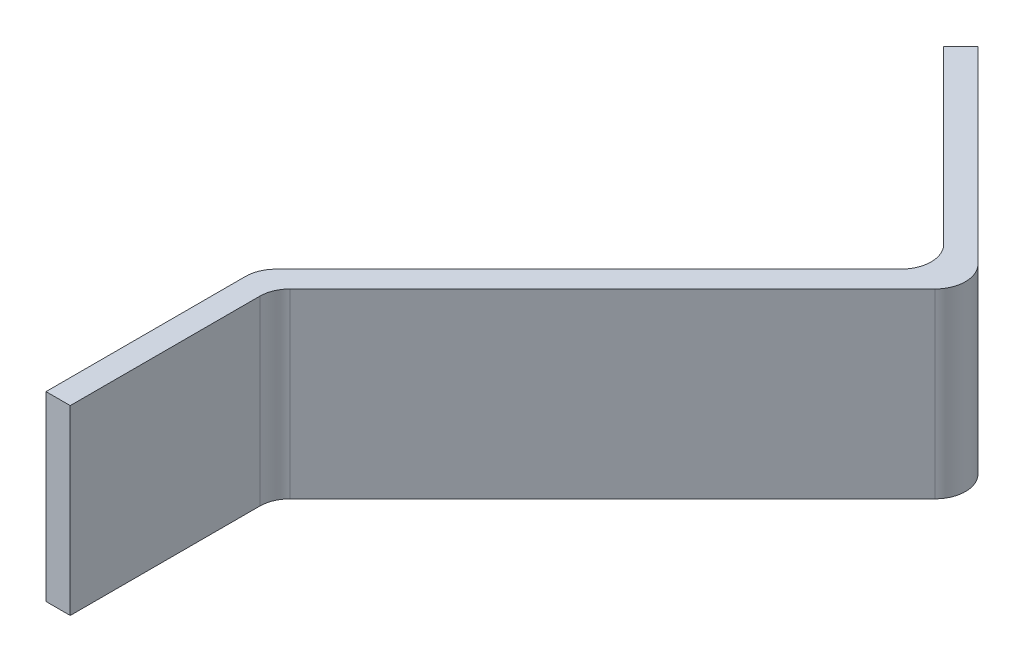
ISO-10303-21;
HEADER;
FILE_DESCRIPTION(('STEP AP214'),'2;1');
FILE_NAME('part.step','',(''),(''),'','','');
FILE_SCHEMA(('AUTOMOTIVE_DESIGN { 1 0 10303 214 1 1 1 1 }'));
ENDSEC;
DATA;
#1=APPLICATION_CONTEXT('core data for automotive mechanical design processes');
#2=APPLICATION_PROTOCOL_DEFINITION('international standard','automotive_design',2000,#1);
#3=PRODUCT_CONTEXT('',#1,'mechanical');
#4=PRODUCT('Part','Part','',(#3));
#5=PRODUCT_RELATED_PRODUCT_CATEGORY('part','',(#4));
#6=PRODUCT_DEFINITION_FORMATION('','',#4);
#7=PRODUCT_DEFINITION_CONTEXT('part definition',#1,'design');
#8=PRODUCT_DEFINITION('design','',#6,#7);
#9=PRODUCT_DEFINITION_SHAPE('','',#8);
#10=(LENGTH_UNIT() NAMED_UNIT(*) SI_UNIT(.MILLI.,.METRE.));
#11=(NAMED_UNIT(*) PLANE_ANGLE_UNIT() SI_UNIT($,.RADIAN.));
#12=(NAMED_UNIT(*) SI_UNIT($,.STERADIAN.) SOLID_ANGLE_UNIT());
#13=UNCERTAINTY_MEASURE_WITH_UNIT(LENGTH_MEASURE(1.E-05),#10,'distance_accuracy_value','');
#14=(GEOMETRIC_REPRESENTATION_CONTEXT(3) GLOBAL_UNCERTAINTY_ASSIGNED_CONTEXT((#13)) GLOBAL_UNIT_ASSIGNED_CONTEXT((#10,
#11,#12)) REPRESENTATION_CONTEXT('',''));
#15=CARTESIAN_POINT('',(0.,0.,0.));
#16=DIRECTION('',(0.,0.,1.));
#17=DIRECTION('',(1.,0.,0.));
#18=AXIS2_PLACEMENT_3D('',#15,#16,#17);
#19=CARTESIAN_POINT('',(245.256587827418,-22.5,-468.225396744416));
#20=DIRECTION('',(0.,1.,0.));
#21=DIRECTION('',(0.,0.,1.));
#22=AXIS2_PLACEMENT_3D('',#19,#20,#21);
#23=CYLINDRICAL_SURFACE('',#22,4.99999999999998);
#24=CARTESIAN_POINT('',(245.256587827418,7.5,-468.225396744416));
#25=DIRECTION('',(0.,1.,0.));
#26=DIRECTION('',(0.,0.,1.));
#27=AXIS2_PLACEMENT_3D('',#24,#25,#26);
#28=CIRCLE('',#27,4.99999999999998);
#29=CARTESIAN_POINT('',(248.79212173335,7.5,-464.689862838483));
#30=VERTEX_POINT('',#29);
#31=CARTESIAN_POINT('',(248.79212173335,7.5,-471.760930650349));
#32=VERTEX_POINT('',#31);
#33=EDGE_CURVE('E154',#30,#32,#28,.T.);
#34=ORIENTED_EDGE('',*,*,#33,.F.);
#35=DIRECTION('',(0.,1.,0.));
#36=VECTOR('',#35,1.);
#37=CARTESIAN_POINT('',(248.79212173335,-22.5,-464.689862838483));
#38=LINE('',#37,#36);
#39=CARTESIAN_POINT('',(248.79212173335,-22.5,-464.689862838483));
#40=VERTEX_POINT('',#39);
#41=EDGE_CURVE('E11',#40,#30,#38,.T.);
#42=ORIENTED_EDGE('',*,*,#41,.F.);
#43=CARTESIAN_POINT('',(245.256587827418,-22.5,-468.225396744416));
#44=DIRECTION('',(0.,1.,0.));
#45=DIRECTION('',(0.,0.,1.));
#46=AXIS2_PLACEMENT_3D('',#43,#44,#45);
#47=CIRCLE('',#46,4.99999999999998);
#48=CARTESIAN_POINT('',(248.79212173335,-22.5,-471.760930650349));
#49=VERTEX_POINT('',#48);
#50=EDGE_CURVE('E186',#40,#49,#47,.T.);
#51=ORIENTED_EDGE('',*,*,#50,.T.);
#52=DIRECTION('',(0.,1.,0.));
#53=VECTOR('',#52,1.);
#54=CARTESIAN_POINT('',(248.79212173335,-22.5,-471.760930650349));
#55=LINE('',#54,#53);
#56=EDGE_CURVE('E36',#49,#32,#55,.T.);
#57=ORIENTED_EDGE('',*,*,#56,.T.);
#58=EDGE_LOOP('',(#34,#42,#51,#57));
#59=FACE_BOUND('',#58,.T.);
#60=ADVANCED_FACE('F33',(#59),#23,.T.);
#61=CARTESIAN_POINT('',(195.566724988934,-22.5,-411.464466094067));
#62=DIRECTION('',(0.707106781186549,0.,0.707106781186546));
#63=DIRECTION('',(0.707106781186546,0.,-0.707106781186549));
#64=AXIS2_PLACEMENT_3D('',#61,#62,#63);
#65=PLANE('',#64);
#66=DIRECTION('',(0.707106781186546,0.,-0.707106781186549));
#67=VECTOR('',#66,1.);
#68=CARTESIAN_POINT('',(195.566724988934,7.5,-411.464466094067));
#69=LINE('',#68,#67);
#70=CARTESIAN_POINT('',(195.566724988934,7.5,-411.464466094067));
#71=VERTEX_POINT('',#70);
#72=EDGE_CURVE('E184',#71,#30,#69,.T.);
#73=ORIENTED_EDGE('',*,*,#72,.F.);
#74=DIRECTION('',(0.,1.,0.));
#75=VECTOR('',#74,1.);
#76=CARTESIAN_POINT('',(195.566724988934,-22.5,-411.464466094067));
#77=LINE('',#76,#75);
#78=CARTESIAN_POINT('',(195.566724988934,-22.5,-411.464466094067));
#79=VERTEX_POINT('',#78);
#80=EDGE_CURVE('E42',#79,#71,#77,.T.);
#81=ORIENTED_EDGE('',*,*,#80,.F.);
#82=DIRECTION('',(0.707106781186546,0.,-0.707106781186549));
#83=VECTOR('',#82,1.);
#84=CARTESIAN_POINT('',(195.566724988934,-22.5,-411.464466094067));
#85=LINE('',#84,#83);
#86=EDGE_CURVE('E144',#79,#40,#85,.T.);
#87=ORIENTED_EDGE('',*,*,#86,.T.);
#88=ORIENTED_EDGE('',*,*,#41,.T.);
#89=EDGE_LOOP('',(#73,#81,#87,#88));
#90=FACE_BOUND('',#89,.T.);
#91=ADVANCED_FACE('F206',(#90),#65,.T.);
#92=CARTESIAN_POINT('',(199.102258894867,-22.5,-407.928932188134));
#93=DIRECTION('',(0.,1.,0.));
#94=DIRECTION('',(0.,0.,1.));
#95=AXIS2_PLACEMENT_3D('',#92,#93,#94);
#96=CYLINDRICAL_SURFACE('',#95,5.00000000000001);
#97=CARTESIAN_POINT('',(199.102258894867,7.5,-407.928932188134));
#98=DIRECTION('',(0.,-1.,0.));
#99=DIRECTION('',(0.,0.,1.));
#100=AXIS2_PLACEMENT_3D('',#97,#98,#99);
#101=CIRCLE('',#100,5.00000000000001);
#102=CARTESIAN_POINT('',(194.102258894867,7.5,-407.928932188134));
#103=VERTEX_POINT('',#102);
#104=EDGE_CURVE('E131',#103,#71,#101,.T.);
#105=ORIENTED_EDGE('',*,*,#104,.F.);
#106=DIRECTION('',(0.,1.,0.));
#107=VECTOR('',#106,1.);
#108=CARTESIAN_POINT('',(194.102258894867,-22.5,-407.928932188134));
#109=LINE('',#108,#107);
#110=CARTESIAN_POINT('',(194.102258894867,-22.5,-407.928932188134));
#111=VERTEX_POINT('',#110);
#112=EDGE_CURVE('E126',#111,#103,#109,.T.);
#113=ORIENTED_EDGE('',*,*,#112,.F.);
#114=CARTESIAN_POINT('',(199.102258894867,-22.5,-407.928932188134));
#115=DIRECTION('',(0.,-1.,0.));
#116=DIRECTION('',(0.,0.,1.));
#117=AXIS2_PLACEMENT_3D('',#114,#115,#116);
#118=CIRCLE('',#117,5.00000000000001);
#119=EDGE_CURVE('E129',#111,#79,#118,.T.);
#120=ORIENTED_EDGE('',*,*,#119,.T.);
#121=ORIENTED_EDGE('',*,*,#80,.T.);
#122=EDGE_LOOP('',(#105,#113,#120,#121));
#123=FACE_BOUND('',#122,.T.);
#124=ADVANCED_FACE('F128',(#123),#96,.F.);
#125=CARTESIAN_POINT('',(194.102258894867,-22.5,-376.656854249492));
#126=DIRECTION('',(1.,0.,0.));
#127=DIRECTION('',(0.,0.,-1.));
#128=AXIS2_PLACEMENT_3D('',#125,#126,#127);
#129=PLANE('',#128);
#130=DIRECTION('',(0.,0.,-1.));
#131=VECTOR('',#130,1.);
#132=CARTESIAN_POINT('',(194.102258894867,7.5,-376.656854249492));
#133=LINE('',#132,#131);
#134=CARTESIAN_POINT('',(194.102258894867,7.5,-376.656854249492));
#135=VERTEX_POINT('',#134);
#136=EDGE_CURVE('E181',#135,#103,#133,.T.);
#137=ORIENTED_EDGE('',*,*,#136,.F.);
#138=DIRECTION('',(0.,1.,0.));
#139=VECTOR('',#138,1.);
#140=CARTESIAN_POINT('',(194.102258894867,-22.5,-376.656854249492));
#141=LINE('',#140,#139);
#142=CARTESIAN_POINT('',(194.102258894867,-22.5,-376.656854249492));
#143=VERTEX_POINT('',#142);
#144=EDGE_CURVE('E136',#143,#135,#141,.T.);
#145=ORIENTED_EDGE('',*,*,#144,.F.);
#146=DIRECTION('',(0.,0.,-1.));
#147=VECTOR('',#146,1.);
#148=CARTESIAN_POINT('',(194.102258894867,-22.5,-376.656854249492));
#149=LINE('',#148,#147);
#150=EDGE_CURVE('E142',#143,#111,#149,.T.);
#151=ORIENTED_EDGE('',*,*,#150,.T.);
#152=ORIENTED_EDGE('',*,*,#112,.T.);
#153=EDGE_LOOP('',(#137,#145,#151,#152));
#154=FACE_BOUND('',#153,.T.);
#155=ADVANCED_FACE('F146',(#154),#129,.T.);
#156=CARTESIAN_POINT('',(190.102258894867,-22.5,-376.656854249492));
#157=DIRECTION('',(0.,0.,1.));
#158=DIRECTION('',(1.,0.,0.));
#159=AXIS2_PLACEMENT_3D('',#156,#157,#158);
#160=PLANE('',#159);
#161=DIRECTION('',(1.,0.,0.));
#162=VECTOR('',#161,1.);
#163=CARTESIAN_POINT('',(190.102258894867,7.5,-376.656854249492));
#164=LINE('',#163,#162);
#165=CARTESIAN_POINT('',(190.102258894867,7.5,-376.656854249492));
#166=VERTEX_POINT('',#165);
#167=EDGE_CURVE('E178',#166,#135,#164,.T.);
#168=ORIENTED_EDGE('',*,*,#167,.F.);
#169=DIRECTION('',(0.,1.,0.));
#170=VECTOR('',#169,1.);
#171=CARTESIAN_POINT('',(190.102258894867,-22.5,-376.656854249492));
#172=LINE('',#171,#170);
#173=CARTESIAN_POINT('',(190.102258894867,-22.5,-376.656854249492));
#174=VERTEX_POINT('',#173);
#175=EDGE_CURVE('E190',#174,#166,#172,.T.);
#176=ORIENTED_EDGE('',*,*,#175,.F.);
#177=DIRECTION('',(1.,0.,0.));
#178=VECTOR('',#177,1.);
#179=CARTESIAN_POINT('',(190.102258894867,-22.5,-376.656854249492));
#180=LINE('',#179,#178);
#181=EDGE_CURVE('E147',#174,#143,#180,.T.);
#182=ORIENTED_EDGE('',*,*,#181,.T.);
#183=ORIENTED_EDGE('',*,*,#144,.T.);
#184=EDGE_LOOP('',(#168,#176,#182,#183));
#185=FACE_BOUND('',#184,.T.);
#186=ADVANCED_FACE('F219',(#185),#160,.T.);
#187=CARTESIAN_POINT('',(190.102258894867,-22.5,-409.585786437627));
#188=DIRECTION('',(-1.,0.,0.));
#189=DIRECTION('',(0.,0.,1.));
#190=AXIS2_PLACEMENT_3D('',#187,#188,#189);
#191=PLANE('',#190);
#192=DIRECTION('',(0.,0.,1.));
#193=VECTOR('',#192,1.);
#194=CARTESIAN_POINT('',(190.102258894867,7.5,-409.585786437627));
#195=LINE('',#194,#193);
#196=CARTESIAN_POINT('',(190.102258894867,7.5,-409.585786437627));
#197=VERTEX_POINT('',#196);
#198=EDGE_CURVE('E175',#197,#166,#195,.T.);
#199=ORIENTED_EDGE('',*,*,#198,.F.);
#200=DIRECTION('',(0.,1.,0.));
#201=VECTOR('',#200,1.);
#202=CARTESIAN_POINT('',(190.102258894867,-22.5,-409.585786437627));
#203=LINE('',#202,#201);
#204=CARTESIAN_POINT('',(190.102258894867,-22.5,-409.585786437627));
#205=VERTEX_POINT('',#204);
#206=EDGE_CURVE('E192',#205,#197,#203,.T.);
#207=ORIENTED_EDGE('',*,*,#206,.F.);
#208=DIRECTION('',(0.,0.,1.));
#209=VECTOR('',#208,1.);
#210=CARTESIAN_POINT('',(190.102258894867,-22.5,-409.585786437627));
#211=LINE('',#210,#209);
#212=EDGE_CURVE('E149',#205,#174,#211,.T.);
#213=ORIENTED_EDGE('',*,*,#212,.T.);
#214=ORIENTED_EDGE('',*,*,#175,.T.);
#215=EDGE_LOOP('',(#199,#207,#213,#214));
#216=FACE_BOUND('',#215,.T.);
#217=ADVANCED_FACE('F222',(#216),#191,.T.);
#218=CARTESIAN_POINT('',(195.102258894867,-22.5,-409.585786437627));
#219=DIRECTION('',(0.,1.,0.));
#220=DIRECTION('',(0.,0.,1.));
#221=AXIS2_PLACEMENT_3D('',#218,#219,#220);
#222=CYLINDRICAL_SURFACE('',#221,5.00000000000001);
#223=CARTESIAN_POINT('',(195.102258894867,7.5,-409.585786437627));
#224=DIRECTION('',(0.,1.,0.));
#225=DIRECTION('',(0.,0.,1.));
#226=AXIS2_PLACEMENT_3D('',#223,#224,#225);
#227=CIRCLE('',#226,5.00000000000001);
#228=CARTESIAN_POINT('',(191.566724988934,7.5,-413.121320343559));
#229=VERTEX_POINT('',#228);
#230=EDGE_CURVE('E172',#229,#197,#227,.T.);
#231=ORIENTED_EDGE('',*,*,#230,.F.);
#232=DIRECTION('',(0.,1.,0.));
#233=VECTOR('',#232,1.);
#234=CARTESIAN_POINT('',(191.566724988934,-22.5,-413.121320343559));
#235=LINE('',#234,#233);
#236=CARTESIAN_POINT('',(191.566724988934,-22.5,-413.121320343559));
#237=VERTEX_POINT('',#236);
#238=EDGE_CURVE('E194',#237,#229,#235,.T.);
#239=ORIENTED_EDGE('',*,*,#238,.F.);
#240=CARTESIAN_POINT('',(195.102258894867,-22.5,-409.585786437627));
#241=DIRECTION('',(0.,1.,0.));
#242=DIRECTION('',(0.,0.,1.));
#243=AXIS2_PLACEMENT_3D('',#240,#241,#242);
#244=CIRCLE('',#243,5.00000000000001);
#245=EDGE_CURVE('E348',#237,#205,#244,.T.);
#246=ORIENTED_EDGE('',*,*,#245,.T.);
#247=ORIENTED_EDGE('',*,*,#206,.T.);
#248=EDGE_LOOP('',(#231,#239,#246,#247));
#249=FACE_BOUND('',#248,.T.);
#250=ADVANCED_FACE('F226',(#249),#222,.T.);
#251=CARTESIAN_POINT('',(243.135267483858,-22.5,-464.689862838483));
#252=DIRECTION('',(-0.707106781186549,0.,-0.707106781186546));
#253=DIRECTION('',(-0.707106781186546,0.,0.707106781186549));
#254=AXIS2_PLACEMENT_3D('',#251,#252,#253);
#255=PLANE('',#254);
#256=DIRECTION('',(-0.707106781186546,0.,0.707106781186549));
#257=VECTOR('',#256,1.);
#258=CARTESIAN_POINT('',(243.135267483858,7.5,-464.689862838483));
#259=LINE('',#258,#257);
#260=CARTESIAN_POINT('',(243.135267483858,7.5,-464.689862838483));
#261=VERTEX_POINT('',#260);
#262=EDGE_CURVE('E169',#261,#229,#259,.T.);
#263=ORIENTED_EDGE('',*,*,#262,.F.);
#264=DIRECTION('',(0.,1.,0.));
#265=VECTOR('',#264,1.);
#266=CARTESIAN_POINT('',(243.135267483858,-22.5,-464.689862838483));
#267=LINE('',#266,#265);
#268=CARTESIAN_POINT('',(243.135267483858,-22.5,-464.689862838483));
#269=VERTEX_POINT('',#268);
#270=EDGE_CURVE('E196',#269,#261,#267,.T.);
#271=ORIENTED_EDGE('',*,*,#270,.F.);
#272=DIRECTION('',(-0.707106781186546,0.,0.707106781186549));
#273=VECTOR('',#272,1.);
#274=CARTESIAN_POINT('',(243.135267483858,-22.5,-464.689862838483));
#275=LINE('',#274,#273);
#276=EDGE_CURVE('E352',#269,#237,#275,.T.);
#277=ORIENTED_EDGE('',*,*,#276,.T.);
#278=ORIENTED_EDGE('',*,*,#238,.T.);
#279=EDGE_LOOP('',(#263,#271,#277,#278));
#280=FACE_BOUND('',#279,.T.);
#281=ADVANCED_FACE('F230',(#280),#255,.T.);
#282=CARTESIAN_POINT('',(239.599733577925,-22.5,-468.225396744416));
#283=DIRECTION('',(0.,1.,0.));
#284=DIRECTION('',(0.,0.,1.));
#285=AXIS2_PLACEMENT_3D('',#282,#283,#284);
#286=CYLINDRICAL_SURFACE('',#285,4.99999999999997);
#287=CARTESIAN_POINT('',(239.599733577925,7.5,-468.225396744416));
#288=DIRECTION('',(0.,-1.,0.));
#289=DIRECTION('',(0.,0.,1.));
#290=AXIS2_PLACEMENT_3D('',#287,#288,#289);
#291=CIRCLE('',#290,4.99999999999997);
#292=CARTESIAN_POINT('',(243.135267483858,7.5,-471.760930650349));
#293=VERTEX_POINT('',#292);
#294=EDGE_CURVE('E166',#293,#261,#291,.T.);
#295=ORIENTED_EDGE('',*,*,#294,.F.);
#296=DIRECTION('',(0.,1.,0.));
#297=VECTOR('',#296,1.);
#298=CARTESIAN_POINT('',(243.135267483858,-22.5,-471.760930650349));
#299=LINE('',#298,#297);
#300=CARTESIAN_POINT('',(243.135267483858,-22.5,-471.760930650349));
#301=VERTEX_POINT('',#300);
#302=EDGE_CURVE('E198',#301,#293,#299,.T.);
#303=ORIENTED_EDGE('',*,*,#302,.F.);
#304=CARTESIAN_POINT('',(239.599733577925,-22.5,-468.225396744416));
#305=DIRECTION('',(0.,-1.,0.));
#306=DIRECTION('',(0.,0.,1.));
#307=AXIS2_PLACEMENT_3D('',#304,#305,#306);
#308=CIRCLE('',#307,4.99999999999997);
#309=EDGE_CURVE('E341',#301,#269,#308,.T.);
#310=ORIENTED_EDGE('',*,*,#309,.T.);
#311=ORIENTED_EDGE('',*,*,#270,.T.);
#312=EDGE_LOOP('',(#295,#303,#310,#311));
#313=FACE_BOUND('',#312,.T.);
#314=ADVANCED_FACE('F234',(#313),#286,.F.);
#315=CARTESIAN_POINT('',(214.850996236396,-22.5,-500.04520189781));
#316=DIRECTION('',(-0.707106781186541,0.,0.707106781186554));
#317=DIRECTION('',(0.707106781186554,0.,0.707106781186541));
#318=AXIS2_PLACEMENT_3D('',#315,#316,#317);
#319=PLANE('',#318);
#320=DIRECTION('',(0.707106781186554,0.,0.707106781186541));
#321=VECTOR('',#320,1.);
#322=CARTESIAN_POINT('',(214.850996236396,7.5,-500.04520189781));
#323=LINE('',#322,#321);
#324=CARTESIAN_POINT('',(214.850996236396,7.5,-500.04520189781));
#325=VERTEX_POINT('',#324);
#326=EDGE_CURVE('E163',#325,#293,#323,.T.);
#327=ORIENTED_EDGE('',*,*,#326,.F.);
#328=DIRECTION('',(0.,1.,0.));
#329=VECTOR('',#328,1.);
#330=CARTESIAN_POINT('',(214.850996236396,-22.5,-500.04520189781));
#331=LINE('',#330,#329);
#332=CARTESIAN_POINT('',(214.850996236396,-22.5,-500.04520189781));
#333=VERTEX_POINT('',#332);
#334=EDGE_CURVE('E200',#333,#325,#331,.T.);
#335=ORIENTED_EDGE('',*,*,#334,.F.);
#336=DIRECTION('',(0.707106781186554,0.,0.707106781186541));
#337=VECTOR('',#336,1.);
#338=CARTESIAN_POINT('',(214.850996236396,-22.5,-500.04520189781));
#339=LINE('',#338,#337);
#340=EDGE_CURVE('E337',#333,#301,#339,.T.);
#341=ORIENTED_EDGE('',*,*,#340,.T.);
#342=ORIENTED_EDGE('',*,*,#302,.T.);
#343=EDGE_LOOP('',(#327,#335,#341,#342));
#344=FACE_BOUND('',#343,.T.);
#345=ADVANCED_FACE('F238',(#344),#319,.T.);
#346=CARTESIAN_POINT('',(217.679423361142,-22.5,-502.873629022557));
#347=DIRECTION('',(-0.707106781186655,0.,-0.70710678118644));
#348=DIRECTION('',(-0.70710678118644,0.,0.707106781186655));
#349=AXIS2_PLACEMENT_3D('',#346,#347,#348);
#350=PLANE('',#349);
#351=DIRECTION('',(-0.70710678118644,0.,0.707106781186655));
#352=VECTOR('',#351,1.);
#353=CARTESIAN_POINT('',(217.679423361142,7.5,-502.873629022557));
#354=LINE('',#353,#352);
#355=CARTESIAN_POINT('',(217.679423361142,7.5,-502.873629022557));
#356=VERTEX_POINT('',#355);
#357=EDGE_CURVE('E160',#356,#325,#354,.T.);
#358=ORIENTED_EDGE('',*,*,#357,.F.);
#359=DIRECTION('',(0.,1.,0.));
#360=VECTOR('',#359,1.);
#361=CARTESIAN_POINT('',(217.679423361142,-22.5,-502.873629022557));
#362=LINE('',#361,#360);
#363=CARTESIAN_POINT('',(217.679423361142,-22.5,-502.873629022557));
#364=VERTEX_POINT('',#363);
#365=EDGE_CURVE('E201',#364,#356,#362,.T.);
#366=ORIENTED_EDGE('',*,*,#365,.F.);
#367=DIRECTION('',(-0.70710678118644,0.,0.707106781186655));
#368=VECTOR('',#367,1.);
#369=CARTESIAN_POINT('',(217.679423361142,-22.5,-502.873629022557));
#370=LINE('',#369,#368);
#371=EDGE_CURVE('E358',#364,#333,#370,.T.);
#372=ORIENTED_EDGE('',*,*,#371,.T.);
#373=ORIENTED_EDGE('',*,*,#334,.T.);
#374=EDGE_LOOP('',(#358,#366,#372,#373));
#375=FACE_BOUND('',#374,.T.);
#376=ADVANCED_FACE('F242',(#375),#350,.T.);
#377=CARTESIAN_POINT('',(248.79212173335,-22.5,-471.760930650349));
#378=DIRECTION('',(0.70710678118655,0.,-0.707106781186545));
#379=DIRECTION('',(-0.707106781186545,0.,-0.70710678118655));
#380=AXIS2_PLACEMENT_3D('',#377,#378,#379);
#381=PLANE('',#380);
#382=DIRECTION('',(-0.707106781186545,0.,-0.70710678118655));
#383=VECTOR('',#382,1.);
#384=CARTESIAN_POINT('',(248.79212173335,7.5,-471.760930650349));
#385=LINE('',#384,#383);
#386=EDGE_CURVE('E157',#32,#356,#385,.T.);
#387=ORIENTED_EDGE('',*,*,#386,.F.);
#388=ORIENTED_EDGE('',*,*,#56,.F.);
#389=DIRECTION('',(-0.707106781186545,0.,-0.70710678118655));
#390=VECTOR('',#389,1.);
#391=CARTESIAN_POINT('',(248.79212173335,-22.5,-471.760930650349));
#392=LINE('',#391,#390);
#393=EDGE_CURVE('E360',#49,#364,#392,.T.);
#394=ORIENTED_EDGE('',*,*,#393,.T.);
#395=ORIENTED_EDGE('',*,*,#365,.T.);
#396=EDGE_LOOP('',(#387,#388,#394,#395));
#397=FACE_BOUND('',#396,.T.);
#398=ADVANCED_FACE('F203',(#397),#381,.T.);
#399=CARTESIAN_POINT('',(245.256587827418,-22.5,-468.225396744416));
#400=DIRECTION('',(0.,1.,0.));
#401=DIRECTION('',(0.,0.,1.));
#402=AXIS2_PLACEMENT_3D('',#399,#400,#401);
#403=PLANE('',#402);
#404=ORIENTED_EDGE('',*,*,#50,.F.);
#405=ORIENTED_EDGE('',*,*,#86,.F.);
#406=ORIENTED_EDGE('',*,*,#119,.F.);
#407=ORIENTED_EDGE('',*,*,#150,.F.);
#408=ORIENTED_EDGE('',*,*,#181,.F.);
#409=ORIENTED_EDGE('',*,*,#212,.F.);
#410=ORIENTED_EDGE('',*,*,#245,.F.);
#411=ORIENTED_EDGE('',*,*,#276,.F.);
#412=ORIENTED_EDGE('',*,*,#309,.F.);
#413=ORIENTED_EDGE('',*,*,#340,.F.);
#414=ORIENTED_EDGE('',*,*,#371,.F.);
#415=ORIENTED_EDGE('',*,*,#393,.F.);
#416=EDGE_LOOP('',(#404,#405,#406,#407,#408,#409,#410,#411,#412,#413,#414,#415));
#417=FACE_BOUND('',#416,.T.);
#418=ADVANCED_FACE('F140',(#417),#403,.F.);
#419=CARTESIAN_POINT('',(245.256587827418,7.5,-468.225396744416));
#420=DIRECTION('',(0.,1.,0.));
#421=DIRECTION('',(0.,0.,1.));
#422=AXIS2_PLACEMENT_3D('',#419,#420,#421);
#423=PLANE('',#422);
#424=ORIENTED_EDGE('',*,*,#33,.T.);
#425=ORIENTED_EDGE('',*,*,#386,.T.);
#426=ORIENTED_EDGE('',*,*,#357,.T.);
#427=ORIENTED_EDGE('',*,*,#326,.T.);
#428=ORIENTED_EDGE('',*,*,#294,.T.);
#429=ORIENTED_EDGE('',*,*,#262,.T.);
#430=ORIENTED_EDGE('',*,*,#230,.T.);
#431=ORIENTED_EDGE('',*,*,#198,.T.);
#432=ORIENTED_EDGE('',*,*,#167,.T.);
#433=ORIENTED_EDGE('',*,*,#136,.T.);
#434=ORIENTED_EDGE('',*,*,#104,.T.);
#435=ORIENTED_EDGE('',*,*,#72,.T.);
#436=EDGE_LOOP('',(#424,#425,#426,#427,#428,#429,#430,#431,#432,#433,#434,#435));
#437=FACE_BOUND('',#436,.T.);
#438=ADVANCED_FACE('F205',(#437),#423,.T.);
#439=CLOSED_SHELL('',(#60,#91,#124,#155,#186,#217,#250,#281,#314,#345,#376,#398,#418,#438));
#440=MANIFOLD_SOLID_BREP('B2',#439);
#441=ADVANCED_BREP_SHAPE_REPRESENTATION('',(#18,#440),#14);
#442=SHAPE_DEFINITION_REPRESENTATION(#9,#441);
ENDSEC;
END-ISO-10303-21;
